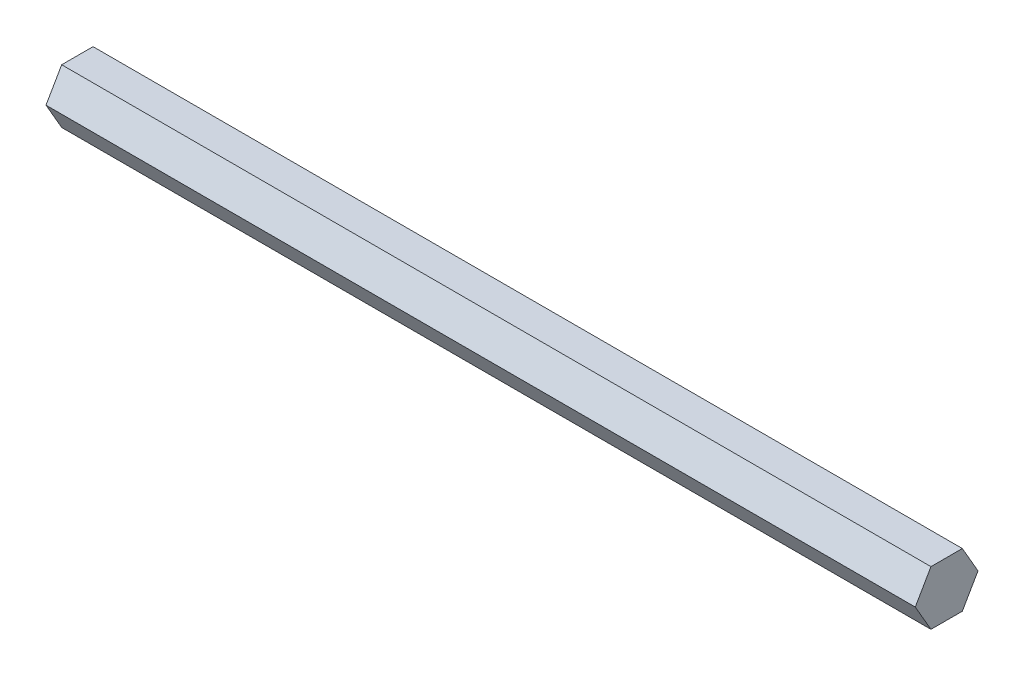
ISO-10303-21;
HEADER;
FILE_DESCRIPTION(('STEP AP214'),'2;1');
FILE_NAME('part.step','',(''),(''),'','','');
FILE_SCHEMA(('AUTOMOTIVE_DESIGN { 1 0 10303 214 1 1 1 1 }'));
ENDSEC;
DATA;
#1=APPLICATION_CONTEXT('core data for automotive mechanical design processes');
#2=APPLICATION_PROTOCOL_DEFINITION('international standard','automotive_design',2000,#1);
#3=PRODUCT_CONTEXT('',#1,'mechanical');
#4=PRODUCT('Part','Part','',(#3));
#5=PRODUCT_RELATED_PRODUCT_CATEGORY('part','',(#4));
#6=PRODUCT_DEFINITION_FORMATION('','',#4);
#7=PRODUCT_DEFINITION_CONTEXT('part definition',#1,'design');
#8=PRODUCT_DEFINITION('design','',#6,#7);
#9=PRODUCT_DEFINITION_SHAPE('','',#8);
#10=(LENGTH_UNIT() NAMED_UNIT(*) SI_UNIT(.MILLI.,.METRE.));
#11=(NAMED_UNIT(*) PLANE_ANGLE_UNIT() SI_UNIT($,.RADIAN.));
#12=(NAMED_UNIT(*) SI_UNIT($,.STERADIAN.) SOLID_ANGLE_UNIT());
#13=UNCERTAINTY_MEASURE_WITH_UNIT(LENGTH_MEASURE(1.E-05),#10,'distance_accuracy_value','');
#14=(GEOMETRIC_REPRESENTATION_CONTEXT(3) GLOBAL_UNCERTAINTY_ASSIGNED_CONTEXT((#13)) GLOBAL_UNIT_ASSIGNED_CONTEXT((#10,
#11,#12)) REPRESENTATION_CONTEXT('',''));
#15=CARTESIAN_POINT('',(0.,0.,0.));
#16=DIRECTION('',(0.,0.,1.));
#17=DIRECTION('',(1.,0.,0.));
#18=AXIS2_PLACEMENT_3D('',#15,#16,#17);
#19=CARTESIAN_POINT('',(203.2,-6.35000000000001,-3.66617420935412));
#20=DIRECTION('',(0.,0.5,0.866025403784439));
#21=DIRECTION('',(0.,-0.866025403784439,0.5));
#22=AXIS2_PLACEMENT_3D('',#19,#20,#21);
#23=PLANE('',#22);
#24=DIRECTION('',(0.,0.866025403784439,-0.5));
#25=VECTOR('',#24,1.);
#26=CARTESIAN_POINT('',(0.,-6.35000000000001,-3.66617420935412));
#27=LINE('',#26,#25);
#28=CARTESIAN_POINT('',(0.,-6.35000000000001,-3.66617420935412));
#29=VERTEX_POINT('',#28);
#30=CARTESIAN_POINT('',(0.,0.,-7.33234841870825));
#31=VERTEX_POINT('',#30);
#32=EDGE_CURVE('E117',#29,#31,#27,.T.);
#33=ORIENTED_EDGE('',*,*,#32,.T.);
#34=DIRECTION('',(-1.,0.,0.));
#35=VECTOR('',#34,1.);
#36=CARTESIAN_POINT('',(203.2,0.,-7.33234841870825));
#37=LINE('',#36,#35);
#38=CARTESIAN_POINT('',(203.2,0.,-7.33234841870825));
#39=VERTEX_POINT('',#38);
#40=EDGE_CURVE('E11',#39,#31,#37,.T.);
#41=ORIENTED_EDGE('',*,*,#40,.F.);
#42=DIRECTION('',(0.,0.866025403784439,-0.5));
#43=VECTOR('',#42,1.);
#44=CARTESIAN_POINT('',(203.2,-6.35000000000001,-3.66617420935412));
#45=LINE('',#44,#43);
#46=CARTESIAN_POINT('',(203.2,-6.35000000000001,-3.66617420935412));
#47=VERTEX_POINT('',#46);
#48=EDGE_CURVE('E127',#47,#39,#45,.T.);
#49=ORIENTED_EDGE('',*,*,#48,.F.);
#50=DIRECTION('',(-1.,0.,0.));
#51=VECTOR('',#50,1.);
#52=CARTESIAN_POINT('',(203.2,-6.35000000000001,-3.66617420935412));
#53=LINE('',#52,#51);
#54=EDGE_CURVE('E113',#47,#29,#53,.T.);
#55=ORIENTED_EDGE('',*,*,#54,.T.);
#56=EDGE_LOOP('',(#33,#41,#49,#55));
#57=FACE_BOUND('',#56,.T.);
#58=ADVANCED_FACE('F33',(#57),#23,.F.);
#59=CARTESIAN_POINT('',(203.2,0.,-7.33234841870825));
#60=DIRECTION('',(0.,-0.5,0.866025403784439));
#61=DIRECTION('',(0.,-0.866025403784439,-0.5));
#62=AXIS2_PLACEMENT_3D('',#59,#60,#61);
#63=PLANE('',#62);
#64=DIRECTION('',(0.,0.866025403784439,0.5));
#65=VECTOR('',#64,1.);
#66=CARTESIAN_POINT('',(0.,0.,-7.33234841870825));
#67=LINE('',#66,#65);
#68=CARTESIAN_POINT('',(0.,6.35000000000001,-3.66617420935412));
#69=VERTEX_POINT('',#68);
#70=EDGE_CURVE('E120',#31,#69,#67,.T.);
#71=ORIENTED_EDGE('',*,*,#70,.T.);
#72=DIRECTION('',(-1.,0.,0.));
#73=VECTOR('',#72,1.);
#74=CARTESIAN_POINT('',(203.2,6.35000000000001,-3.66617420935412));
#75=LINE('',#74,#73);
#76=CARTESIAN_POINT('',(203.2,6.35000000000001,-3.66617420935412));
#77=VERTEX_POINT('',#76);
#78=EDGE_CURVE('E41',#77,#69,#75,.T.);
#79=ORIENTED_EDGE('',*,*,#78,.F.);
#80=DIRECTION('',(0.,0.866025403784439,0.5));
#81=VECTOR('',#80,1.);
#82=CARTESIAN_POINT('',(203.2,0.,-7.33234841870825));
#83=LINE('',#82,#81);
#84=EDGE_CURVE('E86',#39,#77,#83,.T.);
#85=ORIENTED_EDGE('',*,*,#84,.F.);
#86=ORIENTED_EDGE('',*,*,#40,.T.);
#87=EDGE_LOOP('',(#71,#79,#85,#86));
#88=FACE_BOUND('',#87,.T.);
#89=ADVANCED_FACE('F151',(#88),#63,.F.);
#90=CARTESIAN_POINT('',(203.2,6.35000000000001,-3.66617420935412));
#91=DIRECTION('',(0.,-1.,0.));
#92=DIRECTION('',(0.,0.,-1.));
#93=AXIS2_PLACEMENT_3D('',#90,#91,#92);
#94=PLANE('',#93);
#95=DIRECTION('',(0.,0.,1.));
#96=VECTOR('',#95,1.);
#97=CARTESIAN_POINT('',(0.,6.35000000000001,-3.66617420935412));
#98=LINE('',#97,#96);
#99=CARTESIAN_POINT('',(0.,6.35000000000001,3.66617420935413));
#100=VERTEX_POINT('',#99);
#101=EDGE_CURVE('E122',#69,#100,#98,.T.);
#102=ORIENTED_EDGE('',*,*,#101,.T.);
#103=DIRECTION('',(-1.,0.,0.));
#104=VECTOR('',#103,1.);
#105=CARTESIAN_POINT('',(203.2,6.35000000000001,3.66617420935413));
#106=LINE('',#105,#104);
#107=CARTESIAN_POINT('',(203.2,6.35000000000001,3.66617420935413));
#108=VERTEX_POINT('',#107);
#109=EDGE_CURVE('E108',#108,#100,#106,.T.);
#110=ORIENTED_EDGE('',*,*,#109,.F.);
#111=DIRECTION('',(0.,0.,1.));
#112=VECTOR('',#111,1.);
#113=CARTESIAN_POINT('',(203.2,6.35000000000001,-3.66617420935412));
#114=LINE('',#113,#112);
#115=EDGE_CURVE('E99',#77,#108,#114,.T.);
#116=ORIENTED_EDGE('',*,*,#115,.F.);
#117=ORIENTED_EDGE('',*,*,#78,.T.);
#118=EDGE_LOOP('',(#102,#110,#116,#117));
#119=FACE_BOUND('',#118,.T.);
#120=ADVANCED_FACE('F133',(#119),#94,.F.);
#121=CARTESIAN_POINT('',(203.2,6.35000000000001,3.66617420935413));
#122=DIRECTION('',(0.,-0.5,-0.866025403784439));
#123=DIRECTION('',(0.,0.866025403784439,-0.5));
#124=AXIS2_PLACEMENT_3D('',#121,#122,#123);
#125=PLANE('',#124);
#126=DIRECTION('',(0.,-0.866025403784439,0.5));
#127=VECTOR('',#126,1.);
#128=CARTESIAN_POINT('',(0.,6.35000000000001,3.66617420935413));
#129=LINE('',#128,#127);
#130=CARTESIAN_POINT('',(0.,0.,7.33234841870826));
#131=VERTEX_POINT('',#130);
#132=EDGE_CURVE('E107',#100,#131,#129,.T.);
#133=ORIENTED_EDGE('',*,*,#132,.T.);
#134=DIRECTION('',(-1.,0.,0.));
#135=VECTOR('',#134,1.);
#136=CARTESIAN_POINT('',(203.2,0.,7.33234841870826));
#137=LINE('',#136,#135);
#138=CARTESIAN_POINT('',(203.2,0.,7.33234841870826));
#139=VERTEX_POINT('',#138);
#140=EDGE_CURVE('E104',#139,#131,#137,.T.);
#141=ORIENTED_EDGE('',*,*,#140,.F.);
#142=DIRECTION('',(0.,-0.866025403784439,0.5));
#143=VECTOR('',#142,1.);
#144=CARTESIAN_POINT('',(203.2,6.35000000000001,3.66617420935413));
#145=LINE('',#144,#143);
#146=EDGE_CURVE('E93',#108,#139,#145,.T.);
#147=ORIENTED_EDGE('',*,*,#146,.F.);
#148=ORIENTED_EDGE('',*,*,#109,.T.);
#149=EDGE_LOOP('',(#133,#141,#147,#148));
#150=FACE_BOUND('',#149,.T.);
#151=ADVANCED_FACE('F105',(#150),#125,.F.);
#152=CARTESIAN_POINT('',(203.2,0.,7.33234841870826));
#153=DIRECTION('',(0.,0.5,-0.866025403784439));
#154=DIRECTION('',(0.,0.866025403784439,0.5));
#155=AXIS2_PLACEMENT_3D('',#152,#153,#154);
#156=PLANE('',#155);
#157=DIRECTION('',(0.,-0.866025403784439,-0.5));
#158=VECTOR('',#157,1.);
#159=CARTESIAN_POINT('',(0.,0.,7.33234841870826));
#160=LINE('',#159,#158);
#161=CARTESIAN_POINT('',(0.,-6.35000000000001,3.66617420935413));
#162=VERTEX_POINT('',#161);
#163=EDGE_CURVE('E72',#131,#162,#160,.T.);
#164=ORIENTED_EDGE('',*,*,#163,.T.);
#165=DIRECTION('',(-1.,0.,0.));
#166=VECTOR('',#165,1.);
#167=CARTESIAN_POINT('',(203.2,-6.35000000000001,3.66617420935413));
#168=LINE('',#167,#166);
#169=CARTESIAN_POINT('',(203.2,-6.35000000000001,3.66617420935413));
#170=VERTEX_POINT('',#169);
#171=EDGE_CURVE('E109',#170,#162,#168,.T.);
#172=ORIENTED_EDGE('',*,*,#171,.F.);
#173=DIRECTION('',(0.,-0.866025403784439,-0.5));
#174=VECTOR('',#173,1.);
#175=CARTESIAN_POINT('',(203.2,0.,7.33234841870826));
#176=LINE('',#175,#174);
#177=EDGE_CURVE('E97',#139,#170,#176,.T.);
#178=ORIENTED_EDGE('',*,*,#177,.F.);
#179=ORIENTED_EDGE('',*,*,#140,.T.);
#180=EDGE_LOOP('',(#164,#172,#178,#179));
#181=FACE_BOUND('',#180,.T.);
#182=ADVANCED_FACE('F111',(#181),#156,.F.);
#183=CARTESIAN_POINT('',(203.2,-6.35000000000001,3.66617420935413));
#184=DIRECTION('',(0.,1.,0.));
#185=DIRECTION('',(0.,0.,1.));
#186=AXIS2_PLACEMENT_3D('',#183,#184,#185);
#187=PLANE('',#186);
#188=DIRECTION('',(0.,0.,-1.));
#189=VECTOR('',#188,1.);
#190=CARTESIAN_POINT('',(0.,-6.35000000000001,3.66617420935413));
#191=LINE('',#190,#189);
#192=EDGE_CURVE('E78',#162,#29,#191,.T.);
#193=ORIENTED_EDGE('',*,*,#192,.T.);
#194=ORIENTED_EDGE('',*,*,#54,.F.);
#195=DIRECTION('',(0.,0.,-1.));
#196=VECTOR('',#195,1.);
#197=CARTESIAN_POINT('',(203.2,-6.35000000000001,3.66617420935413));
#198=LINE('',#197,#196);
#199=EDGE_CURVE('E49',#170,#47,#198,.T.);
#200=ORIENTED_EDGE('',*,*,#199,.F.);
#201=ORIENTED_EDGE('',*,*,#171,.T.);
#202=EDGE_LOOP('',(#193,#194,#200,#201));
#203=FACE_BOUND('',#202,.T.);
#204=ADVANCED_FACE('F140',(#203),#187,.F.);
#205=CARTESIAN_POINT('',(203.2,0.,0.));
#206=DIRECTION('',(1.,0.,0.));
#207=DIRECTION('',(0.,0.,-1.));
#208=AXIS2_PLACEMENT_3D('',#205,#206,#207);
#209=PLANE('',#208);
#210=ORIENTED_EDGE('',*,*,#48,.T.);
#211=ORIENTED_EDGE('',*,*,#84,.T.);
#212=ORIENTED_EDGE('',*,*,#115,.T.);
#213=ORIENTED_EDGE('',*,*,#146,.T.);
#214=ORIENTED_EDGE('',*,*,#177,.T.);
#215=ORIENTED_EDGE('',*,*,#199,.T.);
#216=EDGE_LOOP('',(#210,#211,#212,#213,#214,#215));
#217=FACE_BOUND('',#216,.T.);
#218=ADVANCED_FACE('F95',(#217),#209,.T.);
#219=CARTESIAN_POINT('',(0.,0.,0.));
#220=DIRECTION('',(1.,0.,0.));
#221=DIRECTION('',(0.,0.,-1.));
#222=AXIS2_PLACEMENT_3D('',#219,#220,#221);
#223=PLANE('',#222);
#224=ORIENTED_EDGE('',*,*,#32,.F.);
#225=ORIENTED_EDGE('',*,*,#192,.F.);
#226=ORIENTED_EDGE('',*,*,#163,.F.);
#227=ORIENTED_EDGE('',*,*,#132,.F.);
#228=ORIENTED_EDGE('',*,*,#101,.F.);
#229=ORIENTED_EDGE('',*,*,#70,.F.);
#230=EDGE_LOOP('',(#224,#225,#226,#227,#228,#229));
#231=FACE_BOUND('',#230,.T.);
#232=ADVANCED_FACE('F136',(#231),#223,.F.);
#233=CLOSED_SHELL('',(#58,#89,#120,#151,#182,#204,#218,#232));
#234=MANIFOLD_SOLID_BREP('B2',#233);
#235=ADVANCED_BREP_SHAPE_REPRESENTATION('',(#18,#234),#14);
#236=SHAPE_DEFINITION_REPRESENTATION(#9,#235);
ENDSEC;
END-ISO-10303-21;
